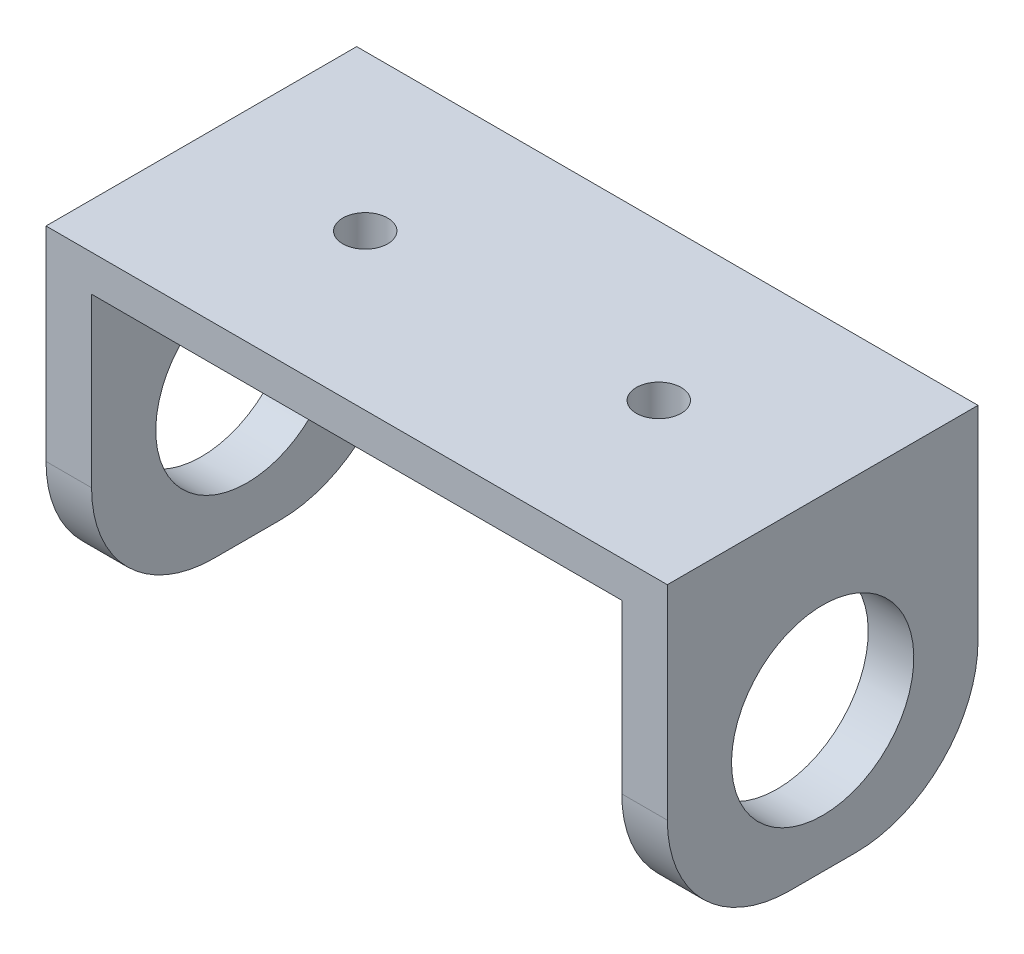
ISO-10303-21;
HEADER;
FILE_DESCRIPTION(('STEP AP214'),'2;1');
FILE_NAME('part.step','',(''),(''),'','','');
FILE_SCHEMA(('AUTOMOTIVE_DESIGN { 1 0 10303 214 1 1 1 1 }'));
ENDSEC;
DATA;
#1=APPLICATION_CONTEXT('core data for automotive mechanical design processes');
#2=APPLICATION_PROTOCOL_DEFINITION('international standard','automotive_design',2000,#1);
#3=PRODUCT_CONTEXT('',#1,'mechanical');
#4=PRODUCT('Part','Part','',(#3));
#5=PRODUCT_RELATED_PRODUCT_CATEGORY('part','',(#4));
#6=PRODUCT_DEFINITION_FORMATION('','',#4);
#7=PRODUCT_DEFINITION_CONTEXT('part definition',#1,'design');
#8=PRODUCT_DEFINITION('design','',#6,#7);
#9=PRODUCT_DEFINITION_SHAPE('','',#8);
#10=(LENGTH_UNIT() NAMED_UNIT(*) SI_UNIT(.MILLI.,.METRE.));
#11=(NAMED_UNIT(*) PLANE_ANGLE_UNIT() SI_UNIT($,.RADIAN.));
#12=(NAMED_UNIT(*) SI_UNIT($,.STERADIAN.) SOLID_ANGLE_UNIT());
#13=UNCERTAINTY_MEASURE_WITH_UNIT(LENGTH_MEASURE(1.E-05),#10,'distance_accuracy_value','');
#14=(GEOMETRIC_REPRESENTATION_CONTEXT(3) GLOBAL_UNCERTAINTY_ASSIGNED_CONTEXT((#13)) GLOBAL_UNIT_ASSIGNED_CONTEXT((#10,
#11,#12)) REPRESENTATION_CONTEXT('',''));
#15=CARTESIAN_POINT('',(0.,0.,0.));
#16=DIRECTION('',(0.,0.,1.));
#17=DIRECTION('',(1.,0.,0.));
#18=AXIS2_PLACEMENT_3D('',#15,#16,#17);
#19=CARTESIAN_POINT('',(-76.7176543751443,44.0382892067442,38.1));
#20=DIRECTION('',(1.,0.,0.));
#21=DIRECTION('',(0.,0.,-1.));
#22=AXIS2_PLACEMENT_3D('',#19,#20,#21);
#23=PLANE('',#22);
#24=CARTESIAN_POINT('',(-76.7176543751443,21.1782892067442,19.05));
#25=DIRECTION('',(1.,0.,0.));
#26=DIRECTION('',(0.,0.,-1.));
#27=AXIS2_PLACEMENT_3D('',#24,#25,#26);
#28=CIRCLE('',#27,11.176);
#29=CARTESIAN_POINT('',(-76.7176543751443,21.1782892067442,7.874));
#30=VERTEX_POINT('',#29);
#31=EDGE_CURVE('E343',#30,#30,#28,.F.);
#32=ORIENTED_EDGE('',*,*,#31,.F.);
#33=EDGE_LOOP('',(#32));
#34=FACE_BOUND('',#33,.T.);
#35=DIRECTION('',(0.,0.,-1.));
#36=VECTOR('',#35,1.);
#37=CARTESIAN_POINT('',(-76.7176543751443,4.02828920674417,38.1));
#38=LINE('',#37,#36);
#39=CARTESIAN_POINT('',(-76.7176543751443,4.02828920674417,23.1));
#40=VERTEX_POINT('',#39);
#41=CARTESIAN_POINT('',(-76.7176543751443,4.02828920674417,15.));
#42=VERTEX_POINT('',#41);
#43=EDGE_CURVE('E268',#40,#42,#38,.T.);
#44=ORIENTED_EDGE('',*,*,#43,.F.);
#45=CARTESIAN_POINT('',(-76.7176543751443,19.0282892067442,23.1));
#46=DIRECTION('',(1.,0.,0.));
#47=DIRECTION('',(0.,0.,-1.));
#48=AXIS2_PLACEMENT_3D('',#45,#46,#47);
#49=CIRCLE('',#48,15.);
#50=CARTESIAN_POINT('',(-76.7176543751443,19.0282892067442,38.1));
#51=VERTEX_POINT('',#50);
#52=EDGE_CURVE('E241',#40,#51,#49,.F.);
#53=ORIENTED_EDGE('',*,*,#52,.T.);
#54=DIRECTION('',(0.,-1.,0.));
#55=VECTOR('',#54,1.);
#56=CARTESIAN_POINT('',(-76.7176543751443,44.0382892067442,38.1));
#57=LINE('',#56,#55);
#58=CARTESIAN_POINT('',(-76.7176543751443,44.0382892067442,38.1));
#59=VERTEX_POINT('',#58);
#60=EDGE_CURVE('E309',#59,#51,#57,.T.);
#61=ORIENTED_EDGE('',*,*,#60,.F.);
#62=DIRECTION('',(0.,0.,-1.));
#63=VECTOR('',#62,1.);
#64=CARTESIAN_POINT('',(-76.7176543751443,44.0382892067442,38.1));
#65=LINE('',#64,#63);
#66=CARTESIAN_POINT('',(-76.7176543751443,44.0382892067442,0.));
#67=VERTEX_POINT('',#66);
#68=EDGE_CURVE('E301',#59,#67,#65,.T.);
#69=ORIENTED_EDGE('',*,*,#68,.T.);
#70=DIRECTION('',(0.,-1.,0.));
#71=VECTOR('',#70,1.);
#72=CARTESIAN_POINT('',(-76.7176543751443,44.0382892067442,0.));
#73=LINE('',#72,#71);
#74=CARTESIAN_POINT('',(-76.7176543751443,19.0282892067442,0.));
#75=VERTEX_POINT('',#74);
#76=EDGE_CURVE('E273',#67,#75,#73,.T.);
#77=ORIENTED_EDGE('',*,*,#76,.T.);
#78=CARTESIAN_POINT('',(-76.7176543751443,19.0282892067442,15.));
#79=DIRECTION('',(1.,0.,0.));
#80=DIRECTION('',(0.,0.,-1.));
#81=AXIS2_PLACEMENT_3D('',#78,#79,#80);
#82=CIRCLE('',#81,15.);
#83=EDGE_CURVE('E244',#75,#42,#82,.F.);
#84=ORIENTED_EDGE('',*,*,#83,.T.);
#85=EDGE_LOOP('',(#44,#53,#61,#69,#77,#84));
#86=FACE_BOUND('',#85,.T.);
#87=ADVANCED_FACE('F41',(#34,#86),#23,.F.);
#88=CARTESIAN_POINT('',(-76.7176543751443,4.02828920674417,38.1));
#89=DIRECTION('',(0.,1.,0.));
#90=DIRECTION('',(0.,0.,1.));
#91=AXIS2_PLACEMENT_3D('',#88,#89,#90);
#92=PLANE('',#91);
#93=DIRECTION('',(0.,0.,-1.));
#94=VECTOR('',#93,1.);
#95=CARTESIAN_POINT('',(-71.1296543751443,4.02828920674417,38.1));
#96=LINE('',#95,#94);
#97=CARTESIAN_POINT('',(-71.1296543751443,4.02828920674417,23.1));
#98=VERTEX_POINT('',#97);
#99=CARTESIAN_POINT('',(-71.1296543751443,4.02828920674417,15.));
#100=VERTEX_POINT('',#99);
#101=EDGE_CURVE('E278',#98,#100,#96,.T.);
#102=ORIENTED_EDGE('',*,*,#101,.F.);
#103=DIRECTION('',(1.,0.,0.));
#104=VECTOR('',#103,1.);
#105=CARTESIAN_POINT('',(-76.7176543751443,4.02828920674418,23.1));
#106=LINE('',#105,#104);
#107=EDGE_CURVE('E247',#98,#40,#106,.F.);
#108=ORIENTED_EDGE('',*,*,#107,.T.);
#109=ORIENTED_EDGE('',*,*,#43,.T.);
#110=DIRECTION('',(1.,0.,0.));
#111=VECTOR('',#110,1.);
#112=CARTESIAN_POINT('',(-76.7176543751443,4.02828920674417,15.));
#113=LINE('',#112,#111);
#114=EDGE_CURVE('E250',#42,#100,#113,.T.);
#115=ORIENTED_EDGE('',*,*,#114,.T.);
#116=EDGE_LOOP('',(#102,#108,#109,#115));
#117=FACE_BOUND('',#116,.T.);
#118=ADVANCED_FACE('F506',(#117),#92,.F.);
#119=CARTESIAN_POINT('',(-71.1296543751443,4.02828920674417,38.1));
#120=DIRECTION('',(-1.,0.,0.));
#121=DIRECTION('',(0.,0.,1.));
#122=AXIS2_PLACEMENT_3D('',#119,#120,#121);
#123=PLANE('',#122);
#124=CARTESIAN_POINT('',(-71.1296543751443,21.1782892067442,19.05));
#125=DIRECTION('',(-1.,0.,0.));
#126=DIRECTION('',(0.,-1.,0.));
#127=AXIS2_PLACEMENT_3D('',#124,#125,#126);
#128=CIRCLE('',#127,11.176);
#129=CARTESIAN_POINT('',(-71.1296543751443,10.0022892067441,19.05));
#130=VERTEX_POINT('',#129);
#131=EDGE_CURVE('E347',#130,#130,#128,.T.);
#132=ORIENTED_EDGE('',*,*,#131,.T.);
#133=EDGE_LOOP('',(#132));
#134=FACE_BOUND('',#133,.T.);
#135=DIRECTION('',(0.,1.,0.));
#136=VECTOR('',#135,1.);
#137=CARTESIAN_POINT('',(-71.1296543751443,4.02828920674417,0.));
#138=LINE('',#137,#136);
#139=CARTESIAN_POINT('',(-71.1296543751443,19.0282892067442,0.));
#140=VERTEX_POINT('',#139);
#141=CARTESIAN_POINT('',(-71.1296543751443,28.6285180454138,0.));
#142=VERTEX_POINT('',#141);
#143=EDGE_CURVE('E316',#140,#142,#138,.T.);
#144=ORIENTED_EDGE('',*,*,#143,.T.);
#145=DIRECTION('',(0.,0.,-1.));
#146=VECTOR('',#145,1.);
#147=CARTESIAN_POINT('',(-71.1296543751443,28.6285180454138,3.));
#148=LINE('',#147,#146);
#149=CARTESIAN_POINT('',(-71.1296543751443,28.6285180454138,3.));
#150=VERTEX_POINT('',#149);
#151=EDGE_CURVE('E59',#150,#142,#148,.T.);
#152=ORIENTED_EDGE('',*,*,#151,.F.);
#153=DIRECTION('',(0.,1.,0.));
#154=VECTOR('',#153,1.);
#155=CARTESIAN_POINT('',(-71.1296543751443,39.5882892067442,3.));
#156=LINE('',#155,#154);
#157=CARTESIAN_POINT('',(-71.1296543751443,39.5882892067442,3.00000000000002));
#158=VERTEX_POINT('',#157);
#159=EDGE_CURVE('E63',#150,#158,#156,.T.);
#160=ORIENTED_EDGE('',*,*,#159,.T.);
#161=DIRECTION('',(0.,0.,-1.));
#162=VECTOR('',#161,1.);
#163=CARTESIAN_POINT('',(-71.1296543751443,39.5882892067442,38.1));
#164=LINE('',#163,#162);
#165=CARTESIAN_POINT('',(-71.1296543751443,39.5882892067442,38.1));
#166=VERTEX_POINT('',#165);
#167=EDGE_CURVE('E282',#166,#158,#164,.T.);
#168=ORIENTED_EDGE('',*,*,#167,.F.);
#169=DIRECTION('',(0.,1.,0.));
#170=VECTOR('',#169,1.);
#171=CARTESIAN_POINT('',(-71.1296543751443,4.02828920674417,38.1));
#172=LINE('',#171,#170);
#173=CARTESIAN_POINT('',(-71.1296543751443,19.0282892067442,38.1));
#174=VERTEX_POINT('',#173);
#175=EDGE_CURVE('E334',#174,#166,#172,.T.);
#176=ORIENTED_EDGE('',*,*,#175,.F.);
#177=CARTESIAN_POINT('',(-71.1296543751443,19.0282892067442,23.1));
#178=DIRECTION('',(-1.,0.,0.));
#179=DIRECTION('',(0.,0.,1.));
#180=AXIS2_PLACEMENT_3D('',#177,#178,#179);
#181=CIRCLE('',#180,15.);
#182=EDGE_CURVE('E254',#174,#98,#181,.F.);
#183=ORIENTED_EDGE('',*,*,#182,.T.);
#184=ORIENTED_EDGE('',*,*,#101,.T.);
#185=CARTESIAN_POINT('',(-71.1296543751443,19.0282892067442,15.));
#186=DIRECTION('',(-1.,0.,0.));
#187=DIRECTION('',(0.,0.,1.));
#188=AXIS2_PLACEMENT_3D('',#185,#186,#187);
#189=CIRCLE('',#188,15.);
#190=EDGE_CURVE('E257',#100,#140,#189,.F.);
#191=ORIENTED_EDGE('',*,*,#190,.T.);
#192=EDGE_LOOP('',(#144,#152,#160,#168,#176,#183,#184,#191));
#193=FACE_BOUND('',#192,.T.);
#194=ADVANCED_FACE('F512',(#134,#193),#123,.F.);
#195=CARTESIAN_POINT('',(-71.1296543751443,39.5882892067442,38.1));
#196=DIRECTION('',(0.,1.,0.));
#197=DIRECTION('',(0.,0.,1.));
#198=AXIS2_PLACEMENT_3D('',#195,#196,#197);
#199=PLANE('',#198);
#200=CARTESIAN_POINT('',(-56.6176543751443,39.5882892067442,19.05));
#201=DIRECTION('',(0.,1.,0.));
#202=DIRECTION('',(0.,0.,1.));
#203=AXIS2_PLACEMENT_3D('',#200,#201,#202);
#204=CIRCLE('',#203,2.75);
#205=CARTESIAN_POINT('',(-56.6176543751443,39.5882892067442,21.8));
#206=VERTEX_POINT('',#205);
#207=EDGE_CURVE('E351',#206,#206,#204,.T.);
#208=ORIENTED_EDGE('',*,*,#207,.T.);
#209=EDGE_LOOP('',(#208));
#210=FACE_BOUND('',#209,.T.);
#211=CARTESIAN_POINT('',(-20.6176543751443,39.5882892067442,19.05));
#212=DIRECTION('',(0.,1.,0.));
#213=DIRECTION('',(0.,0.,1.));
#214=AXIS2_PLACEMENT_3D('',#211,#212,#213);
#215=CIRCLE('',#214,2.75);
#216=CARTESIAN_POINT('',(-20.6176543751443,39.5882892067442,21.8));
#217=VERTEX_POINT('',#216);
#218=EDGE_CURVE('E355',#217,#217,#215,.T.);
#219=ORIENTED_EDGE('',*,*,#218,.T.);
#220=EDGE_LOOP('',(#219));
#221=FACE_BOUND('',#220,.T.);
#222=ORIENTED_EDGE('',*,*,#167,.T.);
#223=DIRECTION('',(1.,0.,0.));
#224=VECTOR('',#223,1.);
#225=CARTESIAN_POINT('',(-6.10565437514433,39.5882892067442,3.));
#226=LINE('',#225,#224);
#227=CARTESIAN_POINT('',(-6.10565437514433,39.5882892067442,3.00000000000002));
#228=VERTEX_POINT('',#227);
#229=EDGE_CURVE('E209',#158,#228,#226,.T.);
#230=ORIENTED_EDGE('',*,*,#229,.T.);
#231=DIRECTION('',(0.,0.,-1.));
#232=VECTOR('',#231,1.);
#233=CARTESIAN_POINT('',(-6.10565437514433,39.5882892067442,38.1));
#234=LINE('',#233,#232);
#235=CARTESIAN_POINT('',(-6.10565437514433,39.5882892067442,38.1));
#236=VERTEX_POINT('',#235);
#237=EDGE_CURVE('E285',#236,#228,#234,.T.);
#238=ORIENTED_EDGE('',*,*,#237,.F.);
#239=DIRECTION('',(1.,0.,0.));
#240=VECTOR('',#239,1.);
#241=CARTESIAN_POINT('',(-71.1296543751443,39.5882892067442,38.1));
#242=LINE('',#241,#240);
#243=EDGE_CURVE('E331',#166,#236,#242,.T.);
#244=ORIENTED_EDGE('',*,*,#243,.F.);
#245=EDGE_LOOP('',(#222,#230,#238,#244));
#246=FACE_BOUND('',#245,.T.);
#247=ADVANCED_FACE('F553',(#210,#221,#246),#199,.F.);
#248=CARTESIAN_POINT('',(-6.10565437514433,39.5882892067442,38.1));
#249=DIRECTION('',(1.,0.,0.));
#250=DIRECTION('',(0.,1.,0.));
#251=AXIS2_PLACEMENT_3D('',#248,#249,#250);
#252=PLANE('',#251);
#253=CARTESIAN_POINT('',(-6.10565437514433,21.1782892067442,19.05));
#254=DIRECTION('',(-1.,0.,0.));
#255=DIRECTION('',(0.,-1.,0.));
#256=AXIS2_PLACEMENT_3D('',#253,#254,#255);
#257=CIRCLE('',#256,11.176);
#258=CARTESIAN_POINT('',(-6.10565437514433,10.0022892067442,19.05));
#259=VERTEX_POINT('',#258);
#260=EDGE_CURVE('E274',#259,#259,#257,.T.);
#261=ORIENTED_EDGE('',*,*,#260,.F.);
#262=EDGE_LOOP('',(#261));
#263=FACE_BOUND('',#262,.T.);
#264=DIRECTION('',(0.,-1.,0.));
#265=VECTOR('',#264,1.);
#266=CARTESIAN_POINT('',(-6.10565437514433,39.5882892067442,3.));
#267=LINE('',#266,#265);
#268=CARTESIAN_POINT('',(-6.10565437514433,28.6285180454138,3.));
#269=VERTEX_POINT('',#268);
#270=EDGE_CURVE('E207',#228,#269,#267,.T.);
#271=ORIENTED_EDGE('',*,*,#270,.T.);
#272=DIRECTION('',(0.,0.,-1.));
#273=VECTOR('',#272,1.);
#274=CARTESIAN_POINT('',(-6.10565437514433,28.6285275743605,3.));
#275=LINE('',#274,#273);
#276=CARTESIAN_POINT('',(-6.10565437514433,28.6285275743605,0.));
#277=VERTEX_POINT('',#276);
#278=EDGE_CURVE('E191',#269,#277,#275,.T.);
#279=ORIENTED_EDGE('',*,*,#278,.T.);
#280=DIRECTION('',(0.,-1.,0.));
#281=VECTOR('',#280,1.);
#282=CARTESIAN_POINT('',(-6.10565437514433,39.5882892067442,0.));
#283=LINE('',#282,#281);
#284=CARTESIAN_POINT('',(-6.10565437514433,19.0282892067442,0.));
#285=VERTEX_POINT('',#284);
#286=EDGE_CURVE('E313',#277,#285,#283,.T.);
#287=ORIENTED_EDGE('',*,*,#286,.T.);
#288=CARTESIAN_POINT('',(-6.10565437514433,19.0282892067442,15.));
#289=DIRECTION('',(1.,0.,0.));
#290=DIRECTION('',(0.,1.,0.));
#291=AXIS2_PLACEMENT_3D('',#288,#289,#290);
#292=CIRCLE('',#291,15.);
#293=CARTESIAN_POINT('',(-6.10565437514433,4.02828920674417,15.));
#294=VERTEX_POINT('',#293);
#295=EDGE_CURVE('E11',#285,#294,#292,.F.);
#296=ORIENTED_EDGE('',*,*,#295,.T.);
#297=DIRECTION('',(0.,0.,-1.));
#298=VECTOR('',#297,1.);
#299=CARTESIAN_POINT('',(-6.10565437514433,4.02828920674417,38.1));
#300=LINE('',#299,#298);
#301=CARTESIAN_POINT('',(-6.10565437514433,4.02828920674417,23.1));
#302=VERTEX_POINT('',#301);
#303=EDGE_CURVE('E289',#302,#294,#300,.T.);
#304=ORIENTED_EDGE('',*,*,#303,.F.);
#305=CARTESIAN_POINT('',(-6.10565437514433,19.0282892067442,23.1));
#306=DIRECTION('',(1.,0.,0.));
#307=DIRECTION('',(0.,1.,0.));
#308=AXIS2_PLACEMENT_3D('',#305,#306,#307);
#309=CIRCLE('',#308,15.);
#310=CARTESIAN_POINT('',(-6.10565437514433,19.0282892067442,38.1));
#311=VERTEX_POINT('',#310);
#312=EDGE_CURVE('E51',#302,#311,#309,.F.);
#313=ORIENTED_EDGE('',*,*,#312,.T.);
#314=DIRECTION('',(0.,-1.,0.));
#315=VECTOR('',#314,1.);
#316=CARTESIAN_POINT('',(-6.10565437514433,39.5882892067442,38.1));
#317=LINE('',#316,#315);
#318=EDGE_CURVE('E327',#236,#311,#317,.T.);
#319=ORIENTED_EDGE('',*,*,#318,.F.);
#320=ORIENTED_EDGE('',*,*,#237,.T.);
#321=EDGE_LOOP('',(#271,#279,#287,#296,#304,#313,#319,#320));
#322=FACE_BOUND('',#321,.T.);
#323=ADVANCED_FACE('F539',(#263,#322),#252,.F.);
#324=CARTESIAN_POINT('',(-6.10565437514433,4.02828920674417,38.1));
#325=DIRECTION('',(0.,1.,0.));
#326=DIRECTION('',(0.,0.,1.));
#327=AXIS2_PLACEMENT_3D('',#324,#325,#326);
#328=PLANE('',#327);
#329=ORIENTED_EDGE('',*,*,#303,.T.);
#330=DIRECTION('',(1.,0.,0.));
#331=VECTOR('',#330,1.);
#332=CARTESIAN_POINT('',(-6.10565437514433,4.02828920674417,15.));
#333=LINE('',#332,#331);
#334=CARTESIAN_POINT('',(-0.517654375144306,4.02828920674417,15.));
#335=VERTEX_POINT('',#334);
#336=EDGE_CURVE('E227',#294,#335,#333,.T.);
#337=ORIENTED_EDGE('',*,*,#336,.T.);
#338=DIRECTION('',(0.,0.,-1.));
#339=VECTOR('',#338,1.);
#340=CARTESIAN_POINT('',(-0.517654375144306,4.02828920674417,38.1));
#341=LINE('',#340,#339);
#342=CARTESIAN_POINT('',(-0.517654375144306,4.02828920674417,23.1));
#343=VERTEX_POINT('',#342);
#344=EDGE_CURVE('E293',#343,#335,#341,.T.);
#345=ORIENTED_EDGE('',*,*,#344,.F.);
#346=DIRECTION('',(1.,0.,0.));
#347=VECTOR('',#346,1.);
#348=CARTESIAN_POINT('',(-6.10565437514433,4.02828920674418,23.1));
#349=LINE('',#348,#347);
#350=EDGE_CURVE('E231',#343,#302,#349,.F.);
#351=ORIENTED_EDGE('',*,*,#350,.T.);
#352=EDGE_LOOP('',(#329,#337,#345,#351));
#353=FACE_BOUND('',#352,.T.);
#354=ADVANCED_FACE('F543',(#353),#328,.F.);
#355=CARTESIAN_POINT('',(-0.517654375144311,44.0382892067442,38.1));
#356=DIRECTION('',(-1.,0.,0.));
#357=DIRECTION('',(0.,-1.,0.));
#358=AXIS2_PLACEMENT_3D('',#355,#356,#357);
#359=PLANE('',#358);
#360=CARTESIAN_POINT('',(-0.517654375144304,21.1782892067442,19.05));
#361=DIRECTION('',(-1.,0.,0.));
#362=DIRECTION('',(0.,-1.,0.));
#363=AXIS2_PLACEMENT_3D('',#360,#361,#362);
#364=CIRCLE('',#363,11.176);
#365=CARTESIAN_POINT('',(-0.517654375144302,10.0022892067442,19.05));
#366=VERTEX_POINT('',#365);
#367=EDGE_CURVE('E269',#366,#366,#364,.T.);
#368=ORIENTED_EDGE('',*,*,#367,.T.);
#369=EDGE_LOOP('',(#368));
#370=FACE_BOUND('',#369,.T.);
#371=ORIENTED_EDGE('',*,*,#344,.T.);
#372=CARTESIAN_POINT('',(-0.517654375144307,19.0282892067442,15.));
#373=DIRECTION('',(-1.,0.,0.));
#374=DIRECTION('',(0.,-1.,0.));
#375=AXIS2_PLACEMENT_3D('',#372,#373,#374);
#376=CIRCLE('',#375,15.);
#377=CARTESIAN_POINT('',(-0.517654375144308,19.0282892067442,0.));
#378=VERTEX_POINT('',#377);
#379=EDGE_CURVE('E221',#335,#378,#376,.F.);
#380=ORIENTED_EDGE('',*,*,#379,.T.);
#381=DIRECTION('',(0.,1.,0.));
#382=VECTOR('',#381,1.);
#383=CARTESIAN_POINT('',(-0.517654375144311,44.0382892067442,0.));
#384=LINE('',#383,#382);
#385=CARTESIAN_POINT('',(-0.517654375144311,44.0382892067442,0.));
#386=VERTEX_POINT('',#385);
#387=EDGE_CURVE('E310',#378,#386,#384,.T.);
#388=ORIENTED_EDGE('',*,*,#387,.T.);
#389=DIRECTION('',(0.,0.,-1.));
#390=VECTOR('',#389,1.);
#391=CARTESIAN_POINT('',(-0.517654375144311,44.0382892067442,38.1));
#392=LINE('',#391,#390);
#393=CARTESIAN_POINT('',(-0.517654375144311,44.0382892067442,38.1));
#394=VERTEX_POINT('',#393);
#395=EDGE_CURVE('E297',#394,#386,#392,.T.);
#396=ORIENTED_EDGE('',*,*,#395,.F.);
#397=DIRECTION('',(0.,1.,0.));
#398=VECTOR('',#397,1.);
#399=CARTESIAN_POINT('',(-0.517654375144311,44.0382892067442,38.1));
#400=LINE('',#399,#398);
#401=CARTESIAN_POINT('',(-0.517654375144308,19.0282892067442,38.1));
#402=VERTEX_POINT('',#401);
#403=EDGE_CURVE('E324',#402,#394,#400,.T.);
#404=ORIENTED_EDGE('',*,*,#403,.F.);
#405=CARTESIAN_POINT('',(-0.517654375144308,19.0282892067442,23.1));
#406=DIRECTION('',(-1.,0.,0.));
#407=DIRECTION('',(0.,-1.,0.));
#408=AXIS2_PLACEMENT_3D('',#405,#406,#407);
#409=CIRCLE('',#408,15.);
#410=EDGE_CURVE('E224',#402,#343,#409,.F.);
#411=ORIENTED_EDGE('',*,*,#410,.T.);
#412=EDGE_LOOP('',(#371,#380,#388,#396,#404,#411));
#413=FACE_BOUND('',#412,.T.);
#414=ADVANCED_FACE('F580',(#370,#413),#359,.F.);
#415=CARTESIAN_POINT('',(-76.7176543751443,44.0382892067442,38.1));
#416=DIRECTION('',(0.,-1.,0.));
#417=DIRECTION('',(0.,0.,-1.));
#418=AXIS2_PLACEMENT_3D('',#415,#416,#417);
#419=PLANE('',#418);
#420=CARTESIAN_POINT('',(-56.6176543751443,44.0382892067442,19.05));
#421=DIRECTION('',(0.,1.,0.));
#422=DIRECTION('',(0.,0.,1.));
#423=AXIS2_PLACEMENT_3D('',#420,#421,#422);
#424=CIRCLE('',#423,2.75);
#425=CARTESIAN_POINT('',(-56.6176543751443,44.0382892067442,21.8));
#426=VERTEX_POINT('',#425);
#427=EDGE_CURVE('E359',#426,#426,#424,.T.);
#428=ORIENTED_EDGE('',*,*,#427,.F.);
#429=EDGE_LOOP('',(#428));
#430=FACE_BOUND('',#429,.T.);
#431=CARTESIAN_POINT('',(-20.6176543751443,44.0382892067442,19.05));
#432=DIRECTION('',(0.,1.,0.));
#433=DIRECTION('',(0.,0.,1.));
#434=AXIS2_PLACEMENT_3D('',#431,#432,#433);
#435=CIRCLE('',#434,2.75);
#436=CARTESIAN_POINT('',(-20.6176543751443,44.0382892067442,21.8));
#437=VERTEX_POINT('',#436);
#438=EDGE_CURVE('E360',#437,#437,#435,.T.);
#439=ORIENTED_EDGE('',*,*,#438,.F.);
#440=EDGE_LOOP('',(#439));
#441=FACE_BOUND('',#440,.T.);
#442=DIRECTION('',(-1.,0.,0.));
#443=VECTOR('',#442,1.);
#444=CARTESIAN_POINT('',(-76.7176543751443,44.0382892067442,0.));
#445=LINE('',#444,#443);
#446=EDGE_CURVE('E306',#386,#67,#445,.T.);
#447=ORIENTED_EDGE('',*,*,#446,.T.);
#448=ORIENTED_EDGE('',*,*,#68,.F.);
#449=DIRECTION('',(-1.,0.,0.));
#450=VECTOR('',#449,1.);
#451=CARTESIAN_POINT('',(-76.7176543751443,44.0382892067442,38.1));
#452=LINE('',#451,#450);
#453=EDGE_CURVE('E305',#394,#59,#452,.T.);
#454=ORIENTED_EDGE('',*,*,#453,.F.);
#455=ORIENTED_EDGE('',*,*,#395,.T.);
#456=EDGE_LOOP('',(#447,#448,#454,#455));
#457=FACE_BOUND('',#456,.T.);
#458=ADVANCED_FACE('F501',(#430,#441,#457),#419,.F.);
#459=CARTESIAN_POINT('',(0.,0.,38.1));
#460=DIRECTION('',(0.,0.,1.));
#461=DIRECTION('',(1.,0.,0.));
#462=AXIS2_PLACEMENT_3D('',#459,#460,#461);
#463=PLANE('',#462);
#464=ORIENTED_EDGE('',*,*,#60,.T.);
#465=DIRECTION('',(1.,0.,0.));
#466=VECTOR('',#465,1.);
#467=CARTESIAN_POINT('',(-71.1296543751443,19.0282892067442,38.1));
#468=LINE('',#467,#466);
#469=EDGE_CURVE('E260',#51,#174,#468,.T.);
#470=ORIENTED_EDGE('',*,*,#469,.T.);
#471=ORIENTED_EDGE('',*,*,#175,.T.);
#472=ORIENTED_EDGE('',*,*,#243,.T.);
#473=ORIENTED_EDGE('',*,*,#318,.T.);
#474=DIRECTION('',(1.,0.,0.));
#475=VECTOR('',#474,1.);
#476=CARTESIAN_POINT('',(-0.517654375144306,19.0282892067442,38.1));
#477=LINE('',#476,#475);
#478=EDGE_CURVE('E264',#311,#402,#477,.T.);
#479=ORIENTED_EDGE('',*,*,#478,.T.);
#480=ORIENTED_EDGE('',*,*,#403,.T.);
#481=ORIENTED_EDGE('',*,*,#453,.T.);
#482=EDGE_LOOP('',(#464,#470,#471,#472,#473,#479,#480,#481));
#483=FACE_BOUND('',#482,.T.);
#484=ADVANCED_FACE('F490',(#483),#463,.T.);
#485=CARTESIAN_POINT('',(0.,0.,0.));
#486=DIRECTION('',(0.,0.,1.));
#487=DIRECTION('',(1.,0.,0.));
#488=AXIS2_PLACEMENT_3D('',#485,#486,#487);
#489=PLANE('',#488);
#490=CARTESIAN_POINT('',(-28.4976543751443,36.6132892067442,0.));
#491=DIRECTION('',(0.,0.,1.));
#492=DIRECTION('',(1.,0.,0.));
#493=AXIS2_PLACEMENT_3D('',#490,#491,#492);
#494=CIRCLE('',#493,1.5);
#495=CARTESIAN_POINT('',(-26.9976543751443,36.6132892067442,0.));
#496=VERTEX_POINT('',#495);
#497=EDGE_CURVE('E442',#496,#496,#494,.T.);
#498=ORIENTED_EDGE('',*,*,#497,.T.);
#499=EDGE_LOOP('',(#498));
#500=FACE_BOUND('',#499,.T.);
#501=CARTESIAN_POINT('',(-48.4976543751443,36.6132892067442,0.));
#502=DIRECTION('',(0.,0.,1.));
#503=DIRECTION('',(1.,0.,0.));
#504=AXIS2_PLACEMENT_3D('',#501,#502,#503);
#505=CIRCLE('',#504,1.5);
#506=CARTESIAN_POINT('',(-46.9976543751443,36.6132892067442,0.));
#507=VERTEX_POINT('',#506);
#508=EDGE_CURVE('E450',#507,#507,#505,.T.);
#509=ORIENTED_EDGE('',*,*,#508,.T.);
#510=EDGE_LOOP('',(#509));
#511=FACE_BOUND('',#510,.T.);
#512=ORIENTED_EDGE('',*,*,#286,.F.);
#513=DIRECTION('',(-1.,0.,0.));
#514=VECTOR('',#513,1.);
#515=CARTESIAN_POINT('',(-6.10565437514433,28.6285275743605,0.));
#516=LINE('',#515,#514);
#517=CARTESIAN_POINT('',(-11.975883213814,28.6285275743605,0.));
#518=VERTEX_POINT('',#517);
#519=EDGE_CURVE('E405',#277,#518,#516,.T.);
#520=ORIENTED_EDGE('',*,*,#519,.T.);
#521=CARTESIAN_POINT('',(-11.975883213814,34.3576177499398,0.));
#522=DIRECTION('',(0.,0.,-1.));
#523=DIRECTION('',(-1.,0.,0.));
#524=AXIS2_PLACEMENT_3D('',#521,#522,#523);
#525=CIRCLE('',#524,5.72909017557927);
#526=CARTESIAN_POINT('',(-16.9856543751443,31.5782892067442,0.));
#527=VERTEX_POINT('',#526);
#528=EDGE_CURVE('E184',#518,#527,#525,.T.);
#529=ORIENTED_EDGE('',*,*,#528,.T.);
#530=CARTESIAN_POINT('',(-19.0456543751443,31.5782892067442,0.));
#531=DIRECTION('',(0.,0.,1.));
#532=DIRECTION('',(1.,0.,0.));
#533=AXIS2_PLACEMENT_3D('',#530,#531,#532);
#534=CIRCLE('',#533,2.05999999999999);
#535=CARTESIAN_POINT('',(-19.0456543751443,33.6382892067442,0.));
#536=VERTEX_POINT('',#535);
#537=EDGE_CURVE('E399',#527,#536,#534,.T.);
#538=ORIENTED_EDGE('',*,*,#537,.T.);
#539=DIRECTION('',(-1.,0.,0.));
#540=VECTOR('',#539,1.);
#541=CARTESIAN_POINT('',(-19.0456543751443,33.6382892067442,0.));
#542=LINE('',#541,#540);
#543=CARTESIAN_POINT('',(-57.9496543751443,33.6382892067442,0.));
#544=VERTEX_POINT('',#543);
#545=EDGE_CURVE('E395',#536,#544,#542,.T.);
#546=ORIENTED_EDGE('',*,*,#545,.T.);
#547=CARTESIAN_POINT('',(-58.189702179566,31.5923231631373,0.));
#548=DIRECTION('',(0.,0.,1.));
#549=DIRECTION('',(-1.,0.,0.));
#550=AXIS2_PLACEMENT_3D('',#547,#548,#549);
#551=CIRCLE('',#550,2.05999999999999);
#552=CARTESIAN_POINT('',(-60.2496543751443,31.5782892067442,0.));
#553=VERTEX_POINT('',#552);
#554=EDGE_CURVE('E391',#544,#553,#551,.T.);
#555=ORIENTED_EDGE('',*,*,#554,.T.);
#556=CARTESIAN_POINT('',(-65.2594255364746,34.35759924266,0.));
#557=DIRECTION('',(0.,0.,-1.));
#558=DIRECTION('',(1.,0.,0.));
#559=AXIS2_PLACEMENT_3D('',#556,#557,#558);
#560=CIRCLE('',#559,5.72908119724615);
#561=CARTESIAN_POINT('',(-65.2594255364746,28.6285180454138,0.));
#562=VERTEX_POINT('',#561);
#563=EDGE_CURVE('E387',#553,#562,#560,.T.);
#564=ORIENTED_EDGE('',*,*,#563,.T.);
#565=DIRECTION('',(-1.,0.,0.));
#566=VECTOR('',#565,1.);
#567=CARTESIAN_POINT('',(-65.2594255364746,28.6285180454138,0.));
#568=LINE('',#567,#566);
#569=EDGE_CURVE('E383',#562,#142,#568,.T.);
#570=ORIENTED_EDGE('',*,*,#569,.T.);
#571=ORIENTED_EDGE('',*,*,#143,.F.);
#572=DIRECTION('',(1.,0.,0.));
#573=VECTOR('',#572,1.);
#574=CARTESIAN_POINT('',(0.,19.0282892067442,0.));
#575=LINE('',#574,#573);
#576=EDGE_CURVE('E234',#140,#75,#575,.F.);
#577=ORIENTED_EDGE('',*,*,#576,.T.);
#578=ORIENTED_EDGE('',*,*,#76,.F.);
#579=ORIENTED_EDGE('',*,*,#446,.F.);
#580=ORIENTED_EDGE('',*,*,#387,.F.);
#581=DIRECTION('',(1.,0.,0.));
#582=VECTOR('',#581,1.);
#583=CARTESIAN_POINT('',(0.,19.0282892067442,0.));
#584=LINE('',#583,#582);
#585=EDGE_CURVE('E237',#378,#285,#584,.F.);
#586=ORIENTED_EDGE('',*,*,#585,.T.);
#587=EDGE_LOOP('',(#512,#520,#529,#538,#546,#555,#564,#570,#571,#577,#578,#579,#580,#586));
#588=FACE_BOUND('',#587,.T.);
#589=CARTESIAN_POINT('',(-11.9856543751443,33.6382892067442,0.));
#590=DIRECTION('',(0.,0.,-1.));
#591=DIRECTION('',(-1.,0.,0.));
#592=AXIS2_PLACEMENT_3D('',#589,#590,#591);
#593=CIRCLE('',#592,2.75);
#594=CARTESIAN_POINT('',(-14.7356543751443,33.6382892067442,0.));
#595=VERTEX_POINT('',#594);
#596=EDGE_CURVE('E438',#595,#595,#593,.T.);
#597=ORIENTED_EDGE('',*,*,#596,.F.);
#598=EDGE_LOOP('',(#597));
#599=FACE_BOUND('',#598,.T.);
#600=CARTESIAN_POINT('',(-65.0096543751443,33.6382892067442,0.));
#601=DIRECTION('',(0.,0.,-1.));
#602=DIRECTION('',(-1.,0.,0.));
#603=AXIS2_PLACEMENT_3D('',#600,#601,#602);
#604=CIRCLE('',#603,2.75000000000001);
#605=CARTESIAN_POINT('',(-67.7596543751443,33.6382892067442,0.));
#606=VERTEX_POINT('',#605);
#607=EDGE_CURVE('E430',#606,#606,#604,.T.);
#608=ORIENTED_EDGE('',*,*,#607,.F.);
#609=EDGE_LOOP('',(#608));
#610=FACE_BOUND('',#609,.T.);
#611=ADVANCED_FACE('F462',(#500,#511,#588,#599,#610),#489,.F.);
#612=CARTESIAN_POINT('',(31.9943456248557,21.1782892067442,19.05));
#613=DIRECTION('',(-1.,0.,0.));
#614=DIRECTION('',(0.,-1.,0.));
#615=AXIS2_PLACEMENT_3D('',#612,#613,#614);
#616=CYLINDRICAL_SURFACE('',#615,11.176);
#617=ORIENTED_EDGE('',*,*,#260,.T.);
#618=EDGE_LOOP('',(#617));
#619=FACE_BOUND('',#618,.T.);
#620=ORIENTED_EDGE('',*,*,#367,.F.);
#621=EDGE_LOOP('',(#620));
#622=FACE_BOUND('',#621,.T.);
#623=ADVANCED_FACE('F489',(#619,#622),#616,.F.);
#624=CARTESIAN_POINT('',(-109.229654375144,21.1782892067442,19.05));
#625=DIRECTION('',(1.,0.,0.));
#626=DIRECTION('',(0.,0.,-1.));
#627=AXIS2_PLACEMENT_3D('',#624,#625,#626);
#628=CYLINDRICAL_SURFACE('',#627,11.176);
#629=ORIENTED_EDGE('',*,*,#131,.F.);
#630=EDGE_LOOP('',(#629));
#631=FACE_BOUND('',#630,.T.);
#632=ORIENTED_EDGE('',*,*,#31,.T.);
#633=EDGE_LOOP('',(#632));
#634=FACE_BOUND('',#633,.T.);
#635=ADVANCED_FACE('F497',(#631,#634),#628,.F.);
#636=CARTESIAN_POINT('',(0.,19.0282892067442,23.1));
#637=DIRECTION('',(-1.,0.,0.));
#638=DIRECTION('',(0.,0.,1.));
#639=AXIS2_PLACEMENT_3D('',#636,#637,#638);
#640=CYLINDRICAL_SURFACE('',#639,15.);
#641=ORIENTED_EDGE('',*,*,#52,.F.);
#642=ORIENTED_EDGE('',*,*,#107,.F.);
#643=ORIENTED_EDGE('',*,*,#182,.F.);
#644=ORIENTED_EDGE('',*,*,#469,.F.);
#645=EDGE_LOOP('',(#641,#642,#643,#644));
#646=FACE_BOUND('',#645,.T.);
#647=ADVANCED_FACE('F519',(#646),#640,.T.);
#648=CARTESIAN_POINT('',(-76.7176543751443,19.0282892067442,15.));
#649=DIRECTION('',(1.,0.,0.));
#650=DIRECTION('',(0.,0.,-1.));
#651=AXIS2_PLACEMENT_3D('',#648,#649,#650);
#652=CYLINDRICAL_SURFACE('',#651,15.);
#653=ORIENTED_EDGE('',*,*,#83,.F.);
#654=ORIENTED_EDGE('',*,*,#576,.F.);
#655=ORIENTED_EDGE('',*,*,#190,.F.);
#656=ORIENTED_EDGE('',*,*,#114,.F.);
#657=EDGE_LOOP('',(#653,#654,#655,#656));
#658=FACE_BOUND('',#657,.T.);
#659=ADVANCED_FACE('F522',(#658),#652,.T.);
#660=CARTESIAN_POINT('',(-6.10565437514433,19.0282892067442,15.));
#661=DIRECTION('',(1.,0.,0.));
#662=DIRECTION('',(0.,0.,-1.));
#663=AXIS2_PLACEMENT_3D('',#660,#661,#662);
#664=CYLINDRICAL_SURFACE('',#663,15.);
#665=ORIENTED_EDGE('',*,*,#295,.F.);
#666=ORIENTED_EDGE('',*,*,#585,.F.);
#667=ORIENTED_EDGE('',*,*,#379,.F.);
#668=ORIENTED_EDGE('',*,*,#336,.F.);
#669=EDGE_LOOP('',(#665,#666,#667,#668));
#670=FACE_BOUND('',#669,.T.);
#671=ADVANCED_FACE('F525',(#670),#664,.T.);
#672=CARTESIAN_POINT('',(0.,19.0282892067442,23.1));
#673=DIRECTION('',(-1.,0.,0.));
#674=DIRECTION('',(0.,0.,1.));
#675=AXIS2_PLACEMENT_3D('',#672,#673,#674);
#676=CYLINDRICAL_SURFACE('',#675,15.);
#677=ORIENTED_EDGE('',*,*,#312,.F.);
#678=ORIENTED_EDGE('',*,*,#350,.F.);
#679=ORIENTED_EDGE('',*,*,#410,.F.);
#680=ORIENTED_EDGE('',*,*,#478,.F.);
#681=EDGE_LOOP('',(#677,#678,#679,#680));
#682=FACE_BOUND('',#681,.T.);
#683=ADVANCED_FACE('F43',(#682),#676,.T.);
#684=CARTESIAN_POINT('',(-20.6176543751443,39.0382892067442,19.05));
#685=DIRECTION('',(0.,1.,0.));
#686=DIRECTION('',(0.,0.,1.));
#687=AXIS2_PLACEMENT_3D('',#684,#685,#686);
#688=CYLINDRICAL_SURFACE('',#687,2.75);
#689=ORIENTED_EDGE('',*,*,#438,.T.);
#690=EDGE_LOOP('',(#689));
#691=FACE_BOUND('',#690,.T.);
#692=ORIENTED_EDGE('',*,*,#218,.F.);
#693=EDGE_LOOP('',(#692));
#694=FACE_BOUND('',#693,.T.);
#695=ADVANCED_FACE('F532',(#691,#694),#688,.F.);
#696=CARTESIAN_POINT('',(-56.6176543751443,39.0382892067442,19.05));
#697=DIRECTION('',(0.,1.,0.));
#698=DIRECTION('',(0.,0.,1.));
#699=AXIS2_PLACEMENT_3D('',#696,#697,#698);
#700=CYLINDRICAL_SURFACE('',#699,2.75);
#701=ORIENTED_EDGE('',*,*,#427,.T.);
#702=EDGE_LOOP('',(#701));
#703=FACE_BOUND('',#702,.T.);
#704=ORIENTED_EDGE('',*,*,#207,.F.);
#705=EDGE_LOOP('',(#704));
#706=FACE_BOUND('',#705,.T.);
#707=ADVANCED_FACE('F620',(#703,#706),#700,.F.);
#708=CARTESIAN_POINT('',(-65.2594255364746,28.6285180454138,3.));
#709=DIRECTION('',(0.,-1.,0.));
#710=DIRECTION('',(1.,0.,0.));
#711=AXIS2_PLACEMENT_3D('',#708,#709,#710);
#712=PLANE('',#711);
#713=ORIENTED_EDGE('',*,*,#569,.F.);
#714=DIRECTION('',(0.,0.,-1.));
#715=VECTOR('',#714,1.);
#716=CARTESIAN_POINT('',(-65.2594255364746,28.6285180454138,3.));
#717=LINE('',#716,#715);
#718=CARTESIAN_POINT('',(-65.2594255364746,28.6285180454138,3.));
#719=VERTEX_POINT('',#718);
#720=EDGE_CURVE('E378',#719,#562,#717,.T.);
#721=ORIENTED_EDGE('',*,*,#720,.F.);
#722=DIRECTION('',(-1.,0.,0.));
#723=VECTOR('',#722,1.);
#724=CARTESIAN_POINT('',(-65.2594255364746,28.6285180454138,3.));
#725=LINE('',#724,#723);
#726=EDGE_CURVE('E216',#719,#150,#725,.T.);
#727=ORIENTED_EDGE('',*,*,#726,.T.);
#728=ORIENTED_EDGE('',*,*,#151,.T.);
#729=EDGE_LOOP('',(#713,#721,#727,#728));
#730=FACE_BOUND('',#729,.T.);
#731=ADVANCED_FACE('F559',(#730),#712,.T.);
#732=CARTESIAN_POINT('',(-65.2594255364746,34.35759924266,3.));
#733=DIRECTION('',(0.,0.,-1.));
#734=DIRECTION('',(-1.,0.,0.));
#735=AXIS2_PLACEMENT_3D('',#732,#733,#734);
#736=CYLINDRICAL_SURFACE('',#735,5.72908119724615);
#737=ORIENTED_EDGE('',*,*,#563,.F.);
#738=DIRECTION('',(0.,0.,-1.));
#739=VECTOR('',#738,1.);
#740=CARTESIAN_POINT('',(-60.2496543751443,31.5782892067442,3.));
#741=LINE('',#740,#739);
#742=CARTESIAN_POINT('',(-60.2496543751443,31.5782892067442,3.));
#743=VERTEX_POINT('',#742);
#744=EDGE_CURVE('E375',#743,#553,#741,.T.);
#745=ORIENTED_EDGE('',*,*,#744,.F.);
#746=CARTESIAN_POINT('',(-65.2594255364746,34.35759924266,3.));
#747=DIRECTION('',(0.,0.,-1.));
#748=DIRECTION('',(1.,0.,0.));
#749=AXIS2_PLACEMENT_3D('',#746,#747,#748);
#750=CIRCLE('',#749,5.72908119724615);
#751=EDGE_CURVE('E412',#743,#719,#750,.T.);
#752=ORIENTED_EDGE('',*,*,#751,.T.);
#753=ORIENTED_EDGE('',*,*,#720,.T.);
#754=EDGE_LOOP('',(#737,#745,#752,#753));
#755=FACE_BOUND('',#754,.T.);
#756=ADVANCED_FACE('F562',(#755),#736,.T.);
#757=CARTESIAN_POINT('',(-58.189702179566,31.5923231631373,3.));
#758=DIRECTION('',(0.,0.,-1.));
#759=DIRECTION('',(-1.,0.,0.));
#760=AXIS2_PLACEMENT_3D('',#757,#758,#759);
#761=CYLINDRICAL_SURFACE('',#760,2.05999999999999);
#762=ORIENTED_EDGE('',*,*,#554,.F.);
#763=DIRECTION('',(0.,0.,-1.));
#764=VECTOR('',#763,1.);
#765=CARTESIAN_POINT('',(-57.9496543751443,33.6382892067442,3.));
#766=LINE('',#765,#764);
#767=CARTESIAN_POINT('',(-57.9496543751443,33.6382892067442,3.));
#768=VERTEX_POINT('',#767);
#769=EDGE_CURVE('E372',#768,#544,#766,.T.);
#770=ORIENTED_EDGE('',*,*,#769,.F.);
#771=CARTESIAN_POINT('',(-58.189702179566,31.5923231631373,3.));
#772=DIRECTION('',(0.,0.,1.));
#773=DIRECTION('',(-1.,0.,0.));
#774=AXIS2_PLACEMENT_3D('',#771,#772,#773);
#775=CIRCLE('',#774,2.05999999999999);
#776=EDGE_CURVE('E416',#768,#743,#775,.T.);
#777=ORIENTED_EDGE('',*,*,#776,.T.);
#778=ORIENTED_EDGE('',*,*,#744,.T.);
#779=EDGE_LOOP('',(#762,#770,#777,#778));
#780=FACE_BOUND('',#779,.T.);
#781=ADVANCED_FACE('F566',(#780),#761,.F.);
#782=CARTESIAN_POINT('',(-19.0456543751443,33.6382892067442,3.));
#783=DIRECTION('',(0.,-1.,0.));
#784=DIRECTION('',(0.,0.,-1.));
#785=AXIS2_PLACEMENT_3D('',#782,#783,#784);
#786=PLANE('',#785);
#787=ORIENTED_EDGE('',*,*,#545,.F.);
#788=DIRECTION('',(0.,0.,-1.));
#789=VECTOR('',#788,1.);
#790=CARTESIAN_POINT('',(-19.0456543751443,33.6382892067442,3.));
#791=LINE('',#790,#789);
#792=CARTESIAN_POINT('',(-19.0456543751443,33.6382892067442,3.));
#793=VERTEX_POINT('',#792);
#794=EDGE_CURVE('E369',#793,#536,#791,.T.);
#795=ORIENTED_EDGE('',*,*,#794,.F.);
#796=DIRECTION('',(-1.,0.,0.));
#797=VECTOR('',#796,1.);
#798=CARTESIAN_POINT('',(-19.0456543751443,33.6382892067442,3.));
#799=LINE('',#798,#797);
#800=EDGE_CURVE('E420',#793,#768,#799,.T.);
#801=ORIENTED_EDGE('',*,*,#800,.T.);
#802=ORIENTED_EDGE('',*,*,#769,.T.);
#803=EDGE_LOOP('',(#787,#795,#801,#802));
#804=FACE_BOUND('',#803,.T.);
#805=ADVANCED_FACE('F569',(#804),#786,.T.);
#806=CARTESIAN_POINT('',(-19.0456543751443,31.5782892067442,3.));
#807=DIRECTION('',(0.,0.,-1.));
#808=DIRECTION('',(-1.,0.,0.));
#809=AXIS2_PLACEMENT_3D('',#806,#807,#808);
#810=CYLINDRICAL_SURFACE('',#809,2.05999999999999);
#811=ORIENTED_EDGE('',*,*,#537,.F.);
#812=DIRECTION('',(0.,0.,-1.));
#813=VECTOR('',#812,1.);
#814=CARTESIAN_POINT('',(-16.9856543751443,31.5782892067442,3.));
#815=LINE('',#814,#813);
#816=CARTESIAN_POINT('',(-16.9856543751443,31.5782892067442,3.));
#817=VERTEX_POINT('',#816);
#818=EDGE_CURVE('E190',#817,#527,#815,.T.);
#819=ORIENTED_EDGE('',*,*,#818,.F.);
#820=CARTESIAN_POINT('',(-19.0456543751443,31.5782892067442,3.));
#821=DIRECTION('',(0.,0.,1.));
#822=DIRECTION('',(1.,0.,0.));
#823=AXIS2_PLACEMENT_3D('',#820,#821,#822);
#824=CIRCLE('',#823,2.05999999999999);
#825=EDGE_CURVE('E201',#817,#793,#824,.T.);
#826=ORIENTED_EDGE('',*,*,#825,.T.);
#827=ORIENTED_EDGE('',*,*,#794,.T.);
#828=EDGE_LOOP('',(#811,#819,#826,#827));
#829=FACE_BOUND('',#828,.T.);
#830=ADVANCED_FACE('F572',(#829),#810,.F.);
#831=CARTESIAN_POINT('',(-11.975883213814,34.3576177499398,3.));
#832=DIRECTION('',(0.,0.,-1.));
#833=DIRECTION('',(-1.,0.,0.));
#834=AXIS2_PLACEMENT_3D('',#831,#832,#833);
#835=CYLINDRICAL_SURFACE('',#834,5.72909017557927);
#836=ORIENTED_EDGE('',*,*,#528,.F.);
#837=DIRECTION('',(0.,0.,-1.));
#838=VECTOR('',#837,1.);
#839=CARTESIAN_POINT('',(-11.975883213814,28.6285275743605,3.));
#840=LINE('',#839,#838);
#841=CARTESIAN_POINT('',(-11.975883213814,28.6285275743605,3.));
#842=VERTEX_POINT('',#841);
#843=EDGE_CURVE('E179',#842,#518,#840,.T.);
#844=ORIENTED_EDGE('',*,*,#843,.F.);
#845=CARTESIAN_POINT('',(-11.975883213814,34.3576177499398,3.));
#846=DIRECTION('',(0.,0.,-1.));
#847=DIRECTION('',(-1.,0.,0.));
#848=AXIS2_PLACEMENT_3D('',#845,#846,#847);
#849=CIRCLE('',#848,5.72909017557927);
#850=EDGE_CURVE('E182',#842,#817,#849,.T.);
#851=ORIENTED_EDGE('',*,*,#850,.T.);
#852=ORIENTED_EDGE('',*,*,#818,.T.);
#853=EDGE_LOOP('',(#836,#844,#851,#852));
#854=FACE_BOUND('',#853,.T.);
#855=ADVANCED_FACE('F181',(#854),#835,.T.);
#856=CARTESIAN_POINT('',(-6.10565437514433,28.6285275743605,3.));
#857=DIRECTION('',(0.,-1.,0.));
#858=DIRECTION('',(0.,0.,-1.));
#859=AXIS2_PLACEMENT_3D('',#856,#857,#858);
#860=PLANE('',#859);
#861=ORIENTED_EDGE('',*,*,#519,.F.);
#862=ORIENTED_EDGE('',*,*,#278,.F.);
#863=DIRECTION('',(-1.,0.,0.));
#864=VECTOR('',#863,1.);
#865=CARTESIAN_POINT('',(-6.10565437514433,28.6285275743605,3.));
#866=LINE('',#865,#864);
#867=EDGE_CURVE('E198',#269,#842,#866,.T.);
#868=ORIENTED_EDGE('',*,*,#867,.T.);
#869=ORIENTED_EDGE('',*,*,#843,.T.);
#870=EDGE_LOOP('',(#861,#862,#868,#869));
#871=FACE_BOUND('',#870,.T.);
#872=ADVANCED_FACE('F205',(#871),#860,.T.);
#873=CARTESIAN_POINT('',(-65.2594255364746,34.35759924266,3.));
#874=DIRECTION('',(0.,0.,1.));
#875=DIRECTION('',(1.,0.,0.));
#876=AXIS2_PLACEMENT_3D('',#873,#874,#875);
#877=PLANE('',#876);
#878=CARTESIAN_POINT('',(-28.4976543751443,36.6132892067442,3.));
#879=DIRECTION('',(0.,0.,1.));
#880=DIRECTION('',(1.,0.,0.));
#881=AXIS2_PLACEMENT_3D('',#878,#879,#880);
#882=CIRCLE('',#881,1.5);
#883=CARTESIAN_POINT('',(-26.9976543751443,36.6132892067442,3.));
#884=VERTEX_POINT('',#883);
#885=EDGE_CURVE('E454',#884,#884,#882,.T.);
#886=ORIENTED_EDGE('',*,*,#885,.F.);
#887=EDGE_LOOP('',(#886));
#888=FACE_BOUND('',#887,.T.);
#889=CARTESIAN_POINT('',(-48.4976543751443,36.6132892067442,3.));
#890=DIRECTION('',(0.,0.,1.));
#891=DIRECTION('',(1.,0.,0.));
#892=AXIS2_PLACEMENT_3D('',#889,#890,#891);
#893=CIRCLE('',#892,1.5);
#894=CARTESIAN_POINT('',(-46.9976543751443,36.6132892067442,3.));
#895=VERTEX_POINT('',#894);
#896=EDGE_CURVE('E446',#895,#895,#893,.T.);
#897=ORIENTED_EDGE('',*,*,#896,.F.);
#898=EDGE_LOOP('',(#897));
#899=FACE_BOUND('',#898,.T.);
#900=CARTESIAN_POINT('',(-11.9856543751443,33.6382892067442,3.));
#901=DIRECTION('',(0.,0.,-1.));
#902=DIRECTION('',(-1.,0.,0.));
#903=AXIS2_PLACEMENT_3D('',#900,#901,#902);
#904=CIRCLE('',#903,2.75);
#905=CARTESIAN_POINT('',(-14.7356543751443,33.6382892067442,3.));
#906=VERTEX_POINT('',#905);
#907=EDGE_CURVE('E434',#906,#906,#904,.T.);
#908=ORIENTED_EDGE('',*,*,#907,.T.);
#909=EDGE_LOOP('',(#908));
#910=FACE_BOUND('',#909,.T.);
#911=CARTESIAN_POINT('',(-65.0096543751443,33.6382892067442,3.));
#912=DIRECTION('',(0.,0.,-1.));
#913=DIRECTION('',(-1.,0.,0.));
#914=AXIS2_PLACEMENT_3D('',#911,#912,#913);
#915=CIRCLE('',#914,2.75000000000001);
#916=CARTESIAN_POINT('',(-67.7596543751443,33.6382892067442,3.));
#917=VERTEX_POINT('',#916);
#918=EDGE_CURVE('E408',#917,#917,#915,.T.);
#919=ORIENTED_EDGE('',*,*,#918,.T.);
#920=EDGE_LOOP('',(#919));
#921=FACE_BOUND('',#920,.T.);
#922=ORIENTED_EDGE('',*,*,#159,.F.);
#923=ORIENTED_EDGE('',*,*,#726,.F.);
#924=ORIENTED_EDGE('',*,*,#751,.F.);
#925=ORIENTED_EDGE('',*,*,#776,.F.);
#926=ORIENTED_EDGE('',*,*,#800,.F.);
#927=ORIENTED_EDGE('',*,*,#825,.F.);
#928=ORIENTED_EDGE('',*,*,#850,.F.);
#929=ORIENTED_EDGE('',*,*,#867,.F.);
#930=ORIENTED_EDGE('',*,*,#270,.F.);
#931=ORIENTED_EDGE('',*,*,#229,.F.);
#932=EDGE_LOOP('',(#922,#923,#924,#925,#926,#927,#928,#929,#930,#931));
#933=FACE_BOUND('',#932,.T.);
#934=ADVANCED_FACE('F196',(#888,#899,#910,#921,#933),#877,.T.);
#935=CARTESIAN_POINT('',(-65.0096543751443,33.6382892067442,3.));
#936=DIRECTION('',(0.,0.,-1.));
#937=DIRECTION('',(-1.,0.,0.));
#938=AXIS2_PLACEMENT_3D('',#935,#936,#937);
#939=CYLINDRICAL_SURFACE('',#938,2.75000000000001);
#940=ORIENTED_EDGE('',*,*,#918,.F.);
#941=EDGE_LOOP('',(#940));
#942=FACE_BOUND('',#941,.T.);
#943=ORIENTED_EDGE('',*,*,#607,.T.);
#944=EDGE_LOOP('',(#943));
#945=FACE_BOUND('',#944,.T.);
#946=ADVANCED_FACE('F474',(#942,#945),#939,.F.);
#947=CARTESIAN_POINT('',(-11.9856543751443,33.6382892067442,3.));
#948=DIRECTION('',(0.,0.,-1.));
#949=DIRECTION('',(-1.,0.,0.));
#950=AXIS2_PLACEMENT_3D('',#947,#948,#949);
#951=CYLINDRICAL_SURFACE('',#950,2.75);
#952=ORIENTED_EDGE('',*,*,#907,.F.);
#953=EDGE_LOOP('',(#952));
#954=FACE_BOUND('',#953,.T.);
#955=ORIENTED_EDGE('',*,*,#596,.T.);
#956=EDGE_LOOP('',(#955));
#957=FACE_BOUND('',#956,.T.);
#958=ADVANCED_FACE('F484',(#954,#957),#951,.F.);
#959=CARTESIAN_POINT('',(-48.4976543751443,36.6132892067442,0.));
#960=DIRECTION('',(0.,0.,1.));
#961=DIRECTION('',(1.,0.,0.));
#962=AXIS2_PLACEMENT_3D('',#959,#960,#961);
#963=CYLINDRICAL_SURFACE('',#962,1.5);
#964=ORIENTED_EDGE('',*,*,#508,.F.);
#965=EDGE_LOOP('',(#964));
#966=FACE_BOUND('',#965,.T.);
#967=ORIENTED_EDGE('',*,*,#896,.T.);
#968=EDGE_LOOP('',(#967));
#969=FACE_BOUND('',#968,.T.);
#970=ADVANCED_FACE('F468',(#966,#969),#963,.F.);
#971=CARTESIAN_POINT('',(-28.4976543751443,36.6132892067442,0.));
#972=DIRECTION('',(0.,0.,1.));
#973=DIRECTION('',(1.,0.,0.));
#974=AXIS2_PLACEMENT_3D('',#971,#972,#973);
#975=CYLINDRICAL_SURFACE('',#974,1.5);
#976=ORIENTED_EDGE('',*,*,#497,.F.);
#977=EDGE_LOOP('',(#976));
#978=FACE_BOUND('',#977,.T.);
#979=ORIENTED_EDGE('',*,*,#885,.T.);
#980=EDGE_LOOP('',(#979));
#981=FACE_BOUND('',#980,.T.);
#982=ADVANCED_FACE('F465',(#978,#981),#975,.F.);
#983=CLOSED_SHELL('',(#87,#118,#194,#247,#323,#354,#414,#458,#484,#611,#623,#635,#647,#659,#671,
#683,#695,#707,#731,#756,#781,#805,#830,#855,#872,#934,#946,#958,#970,#982));
#984=MANIFOLD_SOLID_BREP('B2',#983);
#985=ADVANCED_BREP_SHAPE_REPRESENTATION('',(#18,#984),#14);
#986=SHAPE_DEFINITION_REPRESENTATION(#9,#985);
ENDSEC;
END-ISO-10303-21;
